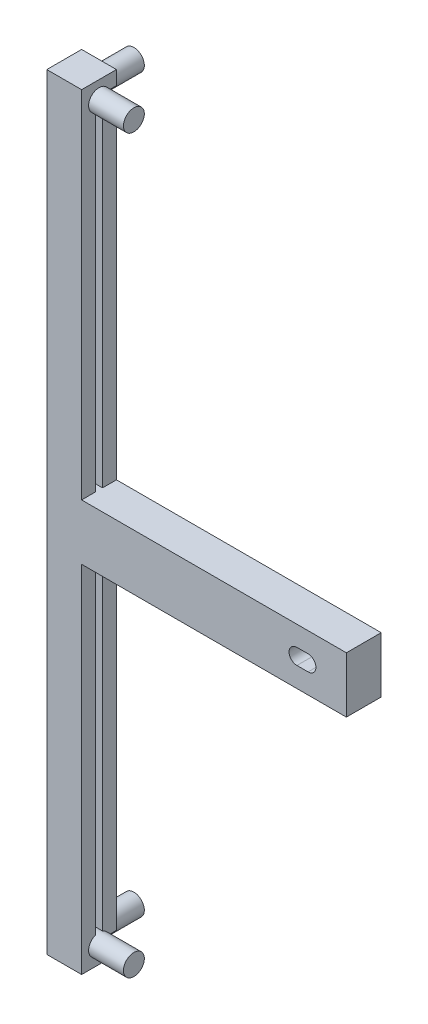
ISO-10303-21;
HEADER;
FILE_DESCRIPTION(('STEP AP214'),'2;1');
FILE_NAME('part.step','',(''),(''),'','','');
FILE_SCHEMA(('AUTOMOTIVE_DESIGN { 1 0 10303 214 1 1 1 1 }'));
ENDSEC;
DATA;
#1=APPLICATION_CONTEXT('core data for automotive mechanical design processes');
#2=APPLICATION_PROTOCOL_DEFINITION('international standard','automotive_design',2000,#1);
#3=PRODUCT_CONTEXT('',#1,'mechanical');
#4=PRODUCT('Part','Part','',(#3));
#5=PRODUCT_RELATED_PRODUCT_CATEGORY('part','',(#4));
#6=PRODUCT_DEFINITION_FORMATION('','',#4);
#7=PRODUCT_DEFINITION_CONTEXT('part definition',#1,'design');
#8=PRODUCT_DEFINITION('design','',#6,#7);
#9=PRODUCT_DEFINITION_SHAPE('','',#8);
#10=(LENGTH_UNIT() NAMED_UNIT(*) SI_UNIT(.MILLI.,.METRE.));
#11=(NAMED_UNIT(*) PLANE_ANGLE_UNIT() SI_UNIT($,.RADIAN.));
#12=(NAMED_UNIT(*) SI_UNIT($,.STERADIAN.) SOLID_ANGLE_UNIT());
#13=UNCERTAINTY_MEASURE_WITH_UNIT(LENGTH_MEASURE(1.E-05),#10,'distance_accuracy_value','');
#14=(GEOMETRIC_REPRESENTATION_CONTEXT(3) GLOBAL_UNCERTAINTY_ASSIGNED_CONTEXT((#13)) GLOBAL_UNIT_ASSIGNED_CONTEXT((#10,
#11,#12)) REPRESENTATION_CONTEXT('',''));
#15=CARTESIAN_POINT('',(0.,0.,0.));
#16=DIRECTION('',(0.,0.,1.));
#17=DIRECTION('',(1.,0.,0.));
#18=AXIS2_PLACEMENT_3D('',#15,#16,#17);
#19=CARTESIAN_POINT('',(0.,-214.,6.5));
#20=DIRECTION('',(0.,1.,0.));
#21=DIRECTION('',(0.,0.,1.));
#22=AXIS2_PLACEMENT_3D('',#19,#20,#21);
#23=PLANE('',#22);
#24=DIRECTION('',(0.,0.,-1.));
#25=VECTOR('',#24,1.);
#26=CARTESIAN_POINT('',(7.82842712474619,-214.,220.));
#27=LINE('',#26,#25);
#28=CARTESIAN_POINT('',(7.82842712474634,-214.,210.));
#29=VERTEX_POINT('',#28);
#30=CARTESIAN_POINT('',(7.82842712474618,-214.,212.171572875254));
#31=VERTEX_POINT('',#30);
#32=EDGE_CURVE('E270',#29,#31,#27,.F.);
#33=ORIENTED_EDGE('',*,*,#32,.F.);
#34=DIRECTION('',(-1.,0.,0.));
#35=VECTOR('',#34,1.);
#36=CARTESIAN_POINT('',(0.,-214.,210.));
#37=LINE('',#36,#35);
#38=CARTESIAN_POINT('',(10.,-214.,210.));
#39=VERTEX_POINT('',#38);
#40=EDGE_CURVE('E481',#39,#29,#37,.T.);
#41=ORIENTED_EDGE('',*,*,#40,.F.);
#42=DIRECTION('',(0.,0.,1.));
#43=VECTOR('',#42,1.);
#44=CARTESIAN_POINT('',(10.,-214.,6.5));
#45=LINE('',#44,#43);
#46=CARTESIAN_POINT('',(10.,-214.,212.171572875254));
#47=VERTEX_POINT('',#46);
#48=EDGE_CURVE('E347',#39,#47,#45,.T.);
#49=ORIENTED_EDGE('',*,*,#48,.T.);
#50=DIRECTION('',(1.,0.,0.));
#51=VECTOR('',#50,1.);
#52=CARTESIAN_POINT('',(0.,-214.,212.171572875254));
#53=LINE('',#52,#51);
#54=EDGE_CURVE('E320',#31,#47,#53,.T.);
#55=ORIENTED_EDGE('',*,*,#54,.F.);
#56=EDGE_LOOP('',(#33,#41,#49,#55));
#57=FACE_BOUND('',#56,.T.);
#58=ADVANCED_FACE('F40',(#57),#23,.F.);
#59=CARTESIAN_POINT('',(0.,-216.,6.5));
#60=DIRECTION('',(0.,1.,0.));
#61=DIRECTION('',(0.,0.,1.));
#62=AXIS2_PLACEMENT_3D('',#59,#60,#61);
#63=PLANE('',#62);
#64=DIRECTION('',(-1.,0.,0.));
#65=VECTOR('',#64,1.);
#66=CARTESIAN_POINT('',(0.,-216.,210.));
#67=LINE('',#66,#65);
#68=CARTESIAN_POINT('',(10.,-216.,210.));
#69=VERTEX_POINT('',#68);
#70=CARTESIAN_POINT('',(7.82842712474604,-216.,210.));
#71=VERTEX_POINT('',#70);
#72=EDGE_CURVE('E267',#69,#71,#67,.T.);
#73=ORIENTED_EDGE('',*,*,#72,.T.);
#74=DIRECTION('',(0.,0.,-1.));
#75=VECTOR('',#74,1.);
#76=CARTESIAN_POINT('',(7.82842712474619,-216.,220.));
#77=LINE('',#76,#75);
#78=CARTESIAN_POINT('',(7.82842712474618,-216.,212.171572875254));
#79=VERTEX_POINT('',#78);
#80=EDGE_CURVE('E264',#71,#79,#77,.F.);
#81=ORIENTED_EDGE('',*,*,#80,.T.);
#82=DIRECTION('',(1.,0.,0.));
#83=VECTOR('',#82,1.);
#84=CARTESIAN_POINT('',(0.,-216.,212.171572875254));
#85=LINE('',#84,#83);
#86=CARTESIAN_POINT('',(10.,-216.,212.171572875254));
#87=VERTEX_POINT('',#86);
#88=EDGE_CURVE('E251',#79,#87,#85,.T.);
#89=ORIENTED_EDGE('',*,*,#88,.T.);
#90=DIRECTION('',(0.,0.,1.));
#91=VECTOR('',#90,1.);
#92=CARTESIAN_POINT('',(10.,-216.,6.5));
#93=LINE('',#92,#91);
#94=EDGE_CURVE('E345',#69,#87,#93,.T.);
#95=ORIENTED_EDGE('',*,*,#94,.F.);
#96=EDGE_LOOP('',(#73,#81,#89,#95));
#97=FACE_BOUND('',#96,.T.);
#98=ADVANCED_FACE('F265',(#97),#63,.T.);
#99=CARTESIAN_POINT('',(6.00000000000001,0.,6.5));
#100=DIRECTION('',(-1.,0.,0.));
#101=DIRECTION('',(0.,-1.,0.));
#102=AXIS2_PLACEMENT_3D('',#99,#100,#101);
#103=PLANE('',#102);
#104=DIRECTION('',(0.,1.,0.));
#105=VECTOR('',#104,1.);
#106=CARTESIAN_POINT('',(5.99999999999963,0.,210.));
#107=LINE('',#106,#105);
#108=CARTESIAN_POINT('',(5.99999999999963,-212.171572875254,210.));
#109=VERTEX_POINT('',#108);
#110=CARTESIAN_POINT('',(5.99999999999963,-7.82842712474632,210.));
#111=VERTEX_POINT('',#110);
#112=EDGE_CURVE('E489',#109,#111,#107,.T.);
#113=ORIENTED_EDGE('',*,*,#112,.F.);
#114=DIRECTION('',(0.,0.,-1.));
#115=VECTOR('',#114,1.);
#116=CARTESIAN_POINT('',(6.00000000000002,-212.171572875254,220.));
#117=LINE('',#116,#115);
#118=CARTESIAN_POINT('',(5.99999999999962,-212.171572875254,213.5));
#119=VERTEX_POINT('',#118);
#120=EDGE_CURVE('E55',#109,#119,#117,.F.);
#121=ORIENTED_EDGE('',*,*,#120,.T.);
#122=DIRECTION('',(0.,-1.,0.));
#123=VECTOR('',#122,1.);
#124=CARTESIAN_POINT('',(5.99999999999962,-6.50000000000001,213.5));
#125=LINE('',#124,#123);
#126=CARTESIAN_POINT('',(5.99999999999962,-7.82842712474619,213.5));
#127=VERTEX_POINT('',#126);
#128=EDGE_CURVE('E362',#127,#119,#125,.T.);
#129=ORIENTED_EDGE('',*,*,#128,.F.);
#130=DIRECTION('',(0.,0.,-1.));
#131=VECTOR('',#130,1.);
#132=CARTESIAN_POINT('',(6.00000000000001,-7.82842712474619,220.));
#133=LINE('',#132,#131);
#134=EDGE_CURVE('E303',#111,#127,#133,.F.);
#135=ORIENTED_EDGE('',*,*,#134,.F.);
#136=EDGE_LOOP('',(#113,#121,#129,#135));
#137=FACE_BOUND('',#136,.T.);
#138=ADVANCED_FACE('F583',(#137),#103,.T.);
#139=CARTESIAN_POINT('',(4.00000000000003,0.,6.5));
#140=DIRECTION('',(-1.,0.,0.));
#141=DIRECTION('',(0.,-1.,0.));
#142=AXIS2_PLACEMENT_3D('',#139,#140,#141);
#143=PLANE('',#142);
#144=DIRECTION('',(0.,0.,-1.));
#145=VECTOR('',#144,1.);
#146=CARTESIAN_POINT('',(4.00000000000002,-212.171572875254,220.));
#147=LINE('',#146,#145);
#148=CARTESIAN_POINT('',(3.99999999999963,-212.171572875254,210.));
#149=VERTEX_POINT('',#148);
#150=CARTESIAN_POINT('',(3.99999999999961,-212.171572875254,213.5));
#151=VERTEX_POINT('',#150);
#152=EDGE_CURVE('E286',#149,#151,#147,.F.);
#153=ORIENTED_EDGE('',*,*,#152,.F.);
#154=DIRECTION('',(0.,1.,0.));
#155=VECTOR('',#154,1.);
#156=CARTESIAN_POINT('',(3.99999999999963,0.,210.));
#157=LINE('',#156,#155);
#158=CARTESIAN_POINT('',(3.99999999999963,-7.82842712474606,210.));
#159=VERTEX_POINT('',#158);
#160=EDGE_CURVE('E491',#149,#159,#157,.T.);
#161=ORIENTED_EDGE('',*,*,#160,.T.);
#162=DIRECTION('',(0.,0.,-1.));
#163=VECTOR('',#162,1.);
#164=CARTESIAN_POINT('',(4.00000000000003,-7.8284271247462,220.));
#165=LINE('',#164,#163);
#166=CARTESIAN_POINT('',(3.99999999999961,-7.8284271247462,213.5));
#167=VERTEX_POINT('',#166);
#168=EDGE_CURVE('E301',#159,#167,#165,.F.);
#169=ORIENTED_EDGE('',*,*,#168,.T.);
#170=DIRECTION('',(0.,-1.,0.));
#171=VECTOR('',#170,1.);
#172=CARTESIAN_POINT('',(3.99999999999961,-6.50000000000001,213.5));
#173=LINE('',#172,#171);
#174=EDGE_CURVE('E364',#167,#151,#173,.T.);
#175=ORIENTED_EDGE('',*,*,#174,.T.);
#176=EDGE_LOOP('',(#153,#161,#169,#175));
#177=FACE_BOUND('',#176,.T.);
#178=ADVANCED_FACE('F587',(#177),#143,.F.);
#179=CARTESIAN_POINT('',(0.,0.,210.));
#180=DIRECTION('',(0.,0.,1.));
#181=DIRECTION('',(1.,0.,0.));
#182=AXIS2_PLACEMENT_3D('',#179,#180,#181);
#183=PLANE('',#182);
#184=CARTESIAN_POINT('',(5.,-215.,210.));
#185=DIRECTION('',(0.,0.,1.));
#186=DIRECTION('',(1.,0.,0.));
#187=AXIS2_PLACEMENT_3D('',#184,#185,#186);
#188=CIRCLE('',#187,3.);
#189=EDGE_CURVE('E282',#71,#149,#188,.F.);
#190=ORIENTED_EDGE('',*,*,#189,.F.);
#191=ORIENTED_EDGE('',*,*,#72,.F.);
#192=DIRECTION('',(0.,1.,0.));
#193=VECTOR('',#192,1.);
#194=CARTESIAN_POINT('',(10.,-158.528956517952,210.));
#195=LINE('',#194,#193);
#196=CARTESIAN_POINT('',(10.,-220.,210.));
#197=VERTEX_POINT('',#196);
#198=EDGE_CURVE('E343',#197,#69,#195,.T.);
#199=ORIENTED_EDGE('',*,*,#198,.F.);
#200=DIRECTION('',(1.,0.,0.));
#201=VECTOR('',#200,1.);
#202=CARTESIAN_POINT('',(0.,-220.,210.));
#203=LINE('',#202,#201);
#204=CARTESIAN_POINT('',(0.,-220.,210.));
#205=VERTEX_POINT('',#204);
#206=EDGE_CURVE('E468',#205,#197,#203,.T.);
#207=ORIENTED_EDGE('',*,*,#206,.F.);
#208=DIRECTION('',(0.,-1.,0.));
#209=VECTOR('',#208,1.);
#210=CARTESIAN_POINT('',(0.,0.,210.));
#211=LINE('',#210,#209);
#212=CARTESIAN_POINT('',(0.,0.,210.));
#213=VERTEX_POINT('',#212);
#214=EDGE_CURVE('E453',#213,#205,#211,.T.);
#215=ORIENTED_EDGE('',*,*,#214,.F.);
#216=DIRECTION('',(-1.,0.,0.));
#217=VECTOR('',#216,1.);
#218=CARTESIAN_POINT('',(0.,0.,210.));
#219=LINE('',#218,#217);
#220=CARTESIAN_POINT('',(10.,0.,210.));
#221=VERTEX_POINT('',#220);
#222=EDGE_CURVE('E460',#221,#213,#219,.T.);
#223=ORIENTED_EDGE('',*,*,#222,.F.);
#224=DIRECTION('',(0.,1.,0.));
#225=VECTOR('',#224,1.);
#226=CARTESIAN_POINT('',(10.,-56.,210.));
#227=LINE('',#226,#225);
#228=CARTESIAN_POINT('',(10.,-4.,210.));
#229=VERTEX_POINT('',#228);
#230=EDGE_CURVE('E341',#229,#221,#227,.T.);
#231=ORIENTED_EDGE('',*,*,#230,.F.);
#232=DIRECTION('',(1.,0.,0.));
#233=VECTOR('',#232,1.);
#234=CARTESIAN_POINT('',(0.,-4.00000000000103,210.));
#235=LINE('',#234,#233);
#236=CARTESIAN_POINT('',(7.82842712474655,-4.00000000000103,210.));
#237=VERTEX_POINT('',#236);
#238=EDGE_CURVE('E479',#237,#229,#235,.T.);
#239=ORIENTED_EDGE('',*,*,#238,.F.);
#240=CARTESIAN_POINT('',(5.,-5.,210.));
#241=DIRECTION('',(0.,0.,1.));
#242=DIRECTION('',(1.,0.,0.));
#243=AXIS2_PLACEMENT_3D('',#240,#241,#242);
#244=CIRCLE('',#243,3.);
#245=EDGE_CURVE('E300',#237,#159,#244,.T.);
#246=ORIENTED_EDGE('',*,*,#245,.T.);
#247=ORIENTED_EDGE('',*,*,#160,.F.);
#248=EDGE_LOOP('',(#190,#191,#199,#207,#215,#223,#231,#239,#246,#247));
#249=FACE_BOUND('',#248,.T.);
#250=ADVANCED_FACE('F516',(#249),#183,.F.);
#251=CARTESIAN_POINT('',(0.,-215.,215.));
#252=DIRECTION('',(1.,0.,0.));
#253=DIRECTION('',(0.,0.,-1.));
#254=AXIS2_PLACEMENT_3D('',#251,#252,#253);
#255=CYLINDRICAL_SURFACE('',#254,2.99999999999999);
#256=CARTESIAN_POINT('',(20.,-215.,215.));
#257=DIRECTION('',(-1.,0.,0.));
#258=DIRECTION('',(0.,0.,1.));
#259=AXIS2_PLACEMENT_3D('',#256,#257,#258);
#260=CIRCLE('',#259,2.99999999999999);
#261=CARTESIAN_POINT('',(20.,-215.,218.));
#262=VERTEX_POINT('',#261);
#263=EDGE_CURVE('E308',#262,#262,#260,.T.);
#264=ORIENTED_EDGE('',*,*,#263,.T.);
#265=EDGE_LOOP('',(#264));
#266=FACE_BOUND('',#265,.T.);
#267=CARTESIAN_POINT('',(5.,-215.,215.));
#268=DIRECTION('',(0.707106781186547,0.,0.707106781186547));
#269=DIRECTION('',(0.707106781186547,0.,-0.707106781186547));
#270=AXIS2_PLACEMENT_3D('',#267,#268,#269);
#271=ELLIPSE('',#270,4.24264068711928,3.);
#272=EDGE_CURVE('E11',#31,#79,#271,.F.);
#273=ORIENTED_EDGE('',*,*,#272,.F.);
#274=ORIENTED_EDGE('',*,*,#54,.T.);
#275=CARTESIAN_POINT('',(10.,-215.,215.));
#276=DIRECTION('',(1.,0.,0.));
#277=DIRECTION('',(0.,0.,-1.));
#278=AXIS2_PLACEMENT_3D('',#275,#276,#277);
#279=CIRCLE('',#278,2.99999999999999);
#280=CARTESIAN_POINT('',(10.,-212.171572875254,214.));
#281=VERTEX_POINT('',#280);
#282=EDGE_CURVE('E317',#281,#47,#279,.F.);
#283=ORIENTED_EDGE('',*,*,#282,.F.);
#284=DIRECTION('',(1.,0.,0.));
#285=VECTOR('',#284,1.);
#286=CARTESIAN_POINT('',(0.,-212.171572875254,214.));
#287=LINE('',#286,#285);
#288=CARTESIAN_POINT('',(6.5,-212.171572875254,214.));
#289=VERTEX_POINT('',#288);
#290=EDGE_CURVE('E311',#281,#289,#287,.F.);
#291=ORIENTED_EDGE('',*,*,#290,.T.);
#292=CARTESIAN_POINT('',(6.5,-215.,215.));
#293=DIRECTION('',(1.,0.,0.));
#294=DIRECTION('',(0.,0.,-1.));
#295=AXIS2_PLACEMENT_3D('',#292,#293,#294);
#296=CIRCLE('',#295,2.99999999999999);
#297=CARTESIAN_POINT('',(6.5,-212.171572875254,216.));
#298=VERTEX_POINT('',#297);
#299=EDGE_CURVE('E314',#298,#289,#296,.F.);
#300=ORIENTED_EDGE('',*,*,#299,.F.);
#301=DIRECTION('',(1.,0.,0.));
#302=VECTOR('',#301,1.);
#303=CARTESIAN_POINT('',(0.,-212.171572875254,216.));
#304=LINE('',#303,#302);
#305=CARTESIAN_POINT('',(10.,-212.171572875254,216.));
#306=VERTEX_POINT('',#305);
#307=EDGE_CURVE('E322',#306,#298,#304,.F.);
#308=ORIENTED_EDGE('',*,*,#307,.F.);
#309=EDGE_CURVE('E256',#87,#306,#279,.F.);
#310=ORIENTED_EDGE('',*,*,#309,.F.);
#311=ORIENTED_EDGE('',*,*,#88,.F.);
#312=EDGE_LOOP('',(#273,#274,#283,#291,#300,#308,#310,#311));
#313=FACE_BOUND('',#312,.T.);
#314=ADVANCED_FACE('F253',(#266,#313),#255,.T.);
#315=CARTESIAN_POINT('',(10.,-10.,220.));
#316=DIRECTION('',(1.,0.,0.));
#317=DIRECTION('',(0.,0.,-1.));
#318=AXIS2_PLACEMENT_3D('',#315,#316,#317);
#319=PLANE('',#318);
#320=ORIENTED_EDGE('',*,*,#94,.T.);
#321=ORIENTED_EDGE('',*,*,#309,.T.);
#322=DIRECTION('',(0.,1.,0.));
#323=VECTOR('',#322,1.);
#324=CARTESIAN_POINT('',(10.,-10.,216.));
#325=LINE('',#324,#323);
#326=CARTESIAN_POINT('',(10.,-118.,216.));
#327=VERTEX_POINT('',#326);
#328=EDGE_CURVE('E448',#306,#327,#325,.T.);
#329=ORIENTED_EDGE('',*,*,#328,.T.);
#330=DIRECTION('',(0.,0.,-1.));
#331=VECTOR('',#330,1.);
#332=CARTESIAN_POINT('',(10.,-118.,220.));
#333=LINE('',#332,#331);
#334=CARTESIAN_POINT('',(10.,-118.,220.));
#335=VERTEX_POINT('',#334);
#336=EDGE_CURVE('E435',#335,#327,#333,.T.);
#337=ORIENTED_EDGE('',*,*,#336,.F.);
#338=DIRECTION('',(0.,-1.,0.));
#339=VECTOR('',#338,1.);
#340=CARTESIAN_POINT('',(10.,-10.,220.));
#341=LINE('',#340,#339);
#342=CARTESIAN_POINT('',(10.,-220.,220.));
#343=VERTEX_POINT('',#342);
#344=EDGE_CURVE('E454',#335,#343,#341,.T.);
#345=ORIENTED_EDGE('',*,*,#344,.T.);
#346=DIRECTION('',(0.,0.,1.));
#347=VECTOR('',#346,1.);
#348=CARTESIAN_POINT('',(10.,-220.,10.));
#349=LINE('',#348,#347);
#350=EDGE_CURVE('E350',#197,#343,#349,.T.);
#351=ORIENTED_EDGE('',*,*,#350,.F.);
#352=ORIENTED_EDGE('',*,*,#198,.T.);
#353=EDGE_LOOP('',(#320,#321,#329,#337,#345,#351,#352));
#354=FACE_BOUND('',#353,.T.);
#355=ADVANCED_FACE('F597',(#354),#319,.T.);
#356=CARTESIAN_POINT('',(6.5,-6.50000000000001,216.));
#357=DIRECTION('',(0.,0.,-1.));
#358=DIRECTION('',(-1.,0.,0.));
#359=AXIS2_PLACEMENT_3D('',#356,#357,#358);
#360=PLANE('',#359);
#361=ORIENTED_EDGE('',*,*,#328,.F.);
#362=ORIENTED_EDGE('',*,*,#307,.T.);
#363=DIRECTION('',(0.,-1.,0.));
#364=VECTOR('',#363,1.);
#365=CARTESIAN_POINT('',(6.5,-6.50000000000001,216.));
#366=LINE('',#365,#364);
#367=CARTESIAN_POINT('',(6.5,-118.,216.));
#368=VERTEX_POINT('',#367);
#369=EDGE_CURVE('E441',#368,#298,#366,.T.);
#370=ORIENTED_EDGE('',*,*,#369,.F.);
#371=DIRECTION('',(-1.,0.,0.));
#372=VECTOR('',#371,1.);
#373=CARTESIAN_POINT('',(6.5,-118.,216.));
#374=LINE('',#373,#372);
#375=EDGE_CURVE('E432',#327,#368,#374,.T.);
#376=ORIENTED_EDGE('',*,*,#375,.F.);
#377=EDGE_LOOP('',(#361,#362,#370,#376));
#378=FACE_BOUND('',#377,.T.);
#379=ADVANCED_FACE('F601',(#378),#360,.T.);
#380=CARTESIAN_POINT('',(6.5,-6.50000000000001,214.));
#381=DIRECTION('',(0.,0.,-1.));
#382=DIRECTION('',(-1.,0.,0.));
#383=AXIS2_PLACEMENT_3D('',#380,#381,#382);
#384=PLANE('',#383);
#385=ORIENTED_EDGE('',*,*,#290,.F.);
#386=DIRECTION('',(0.,1.,0.));
#387=VECTOR('',#386,1.);
#388=CARTESIAN_POINT('',(10.,-10.,214.));
#389=LINE('',#388,#387);
#390=CARTESIAN_POINT('',(10.,-118.,214.));
#391=VERTEX_POINT('',#390);
#392=EDGE_CURVE('E445',#281,#391,#389,.T.);
#393=ORIENTED_EDGE('',*,*,#392,.T.);
#394=DIRECTION('',(-1.,0.,0.));
#395=VECTOR('',#394,1.);
#396=CARTESIAN_POINT('',(6.5,-118.,214.));
#397=LINE('',#396,#395);
#398=CARTESIAN_POINT('',(6.5,-118.,214.));
#399=VERTEX_POINT('',#398);
#400=EDGE_CURVE('E487',#391,#399,#397,.T.);
#401=ORIENTED_EDGE('',*,*,#400,.T.);
#402=DIRECTION('',(0.,-1.,0.));
#403=VECTOR('',#402,1.);
#404=CARTESIAN_POINT('',(6.5,-6.50000000000001,214.));
#405=LINE('',#404,#403);
#406=EDGE_CURVE('E438',#399,#289,#405,.T.);
#407=ORIENTED_EDGE('',*,*,#406,.T.);
#408=EDGE_LOOP('',(#385,#393,#401,#407));
#409=FACE_BOUND('',#408,.T.);
#410=ADVANCED_FACE('F604',(#409),#384,.F.);
#411=CARTESIAN_POINT('',(5.99999999999962,-6.50000000000001,213.5));
#412=DIRECTION('',(0.,0.,1.));
#413=DIRECTION('',(1.,0.,0.));
#414=AXIS2_PLACEMENT_3D('',#411,#412,#413);
#415=PLANE('',#414);
#416=CARTESIAN_POINT('',(5.,-215.,213.5));
#417=DIRECTION('',(0.,0.,1.));
#418=DIRECTION('',(1.,0.,0.));
#419=AXIS2_PLACEMENT_3D('',#416,#417,#418);
#420=CIRCLE('',#419,3.);
#421=EDGE_CURVE('E62',#151,#119,#420,.F.);
#422=ORIENTED_EDGE('',*,*,#421,.F.);
#423=ORIENTED_EDGE('',*,*,#174,.F.);
#424=CARTESIAN_POINT('',(5.,-5.,213.5));
#425=DIRECTION('',(0.,0.,1.));
#426=DIRECTION('',(1.,0.,0.));
#427=AXIS2_PLACEMENT_3D('',#424,#425,#426);
#428=CIRCLE('',#427,3.);
#429=EDGE_CURVE('E306',#167,#127,#428,.T.);
#430=ORIENTED_EDGE('',*,*,#429,.T.);
#431=ORIENTED_EDGE('',*,*,#128,.T.);
#432=EDGE_LOOP('',(#422,#423,#430,#431));
#433=FACE_BOUND('',#432,.T.);
#434=ADVANCED_FACE('F608',(#433),#415,.F.);
#435=CARTESIAN_POINT('',(10.,-5.,215.));
#436=DIRECTION('',(1.,0.,0.));
#437=DIRECTION('',(0.,0.,-1.));
#438=AXIS2_PLACEMENT_3D('',#435,#436,#437);
#439=CIRCLE('',#438,2.99999999999999);
#440=CARTESIAN_POINT('',(10.,-4.,212.171572875254));
#441=VERTEX_POINT('',#440);
#442=CARTESIAN_POINT('',(10.,-7.82842712474618,216.));
#443=VERTEX_POINT('',#442);
#444=EDGE_CURVE('E333',#441,#443,#439,.T.);
#445=ORIENTED_EDGE('',*,*,#444,.F.);
#446=DIRECTION('',(0.,0.,1.));
#447=VECTOR('',#446,1.);
#448=CARTESIAN_POINT('',(10.,-4.,6.5));
#449=LINE('',#448,#447);
#450=EDGE_CURVE('E353',#229,#441,#449,.T.);
#451=ORIENTED_EDGE('',*,*,#450,.F.);
#452=ORIENTED_EDGE('',*,*,#230,.T.);
#453=DIRECTION('',(0.,0.,-1.));
#454=VECTOR('',#453,1.);
#455=CARTESIAN_POINT('',(10.,0.,10.));
#456=LINE('',#455,#454);
#457=CARTESIAN_POINT('',(10.,0.,220.));
#458=VERTEX_POINT('',#457);
#459=EDGE_CURVE('E359',#458,#221,#456,.T.);
#460=ORIENTED_EDGE('',*,*,#459,.F.);
#461=CARTESIAN_POINT('',(10.,-102.,220.));
#462=VERTEX_POINT('',#461);
#463=EDGE_CURVE('E451',#458,#462,#341,.T.);
#464=ORIENTED_EDGE('',*,*,#463,.T.);
#465=DIRECTION('',(0.,0.,-1.));
#466=VECTOR('',#465,1.);
#467=CARTESIAN_POINT('',(10.,-102.,220.));
#468=LINE('',#467,#466);
#469=CARTESIAN_POINT('',(10.,-102.,216.));
#470=VERTEX_POINT('',#469);
#471=EDGE_CURVE('E424',#462,#470,#468,.T.);
#472=ORIENTED_EDGE('',*,*,#471,.T.);
#473=EDGE_CURVE('E447',#470,#443,#325,.T.);
#474=ORIENTED_EDGE('',*,*,#473,.T.);
#475=EDGE_LOOP('',(#445,#451,#452,#460,#464,#472,#474));
#476=FACE_BOUND('',#475,.T.);
#477=ADVANCED_FACE('F511',(#476),#319,.T.);
#478=DIRECTION('',(1.,0.,0.));
#479=VECTOR('',#478,1.);
#480=CARTESIAN_POINT('',(0.,-7.82842712474618,216.));
#481=LINE('',#480,#479);
#482=CARTESIAN_POINT('',(6.5,-7.82842712474618,216.));
#483=VERTEX_POINT('',#482);
#484=EDGE_CURVE('E337',#443,#483,#481,.F.);
#485=ORIENTED_EDGE('',*,*,#484,.F.);
#486=ORIENTED_EDGE('',*,*,#473,.F.);
#487=DIRECTION('',(-1.,0.,0.));
#488=VECTOR('',#487,1.);
#489=CARTESIAN_POINT('',(6.5,-102.,216.));
#490=LINE('',#489,#488);
#491=CARTESIAN_POINT('',(6.5,-102.,216.));
#492=VERTEX_POINT('',#491);
#493=EDGE_CURVE('E421',#470,#492,#490,.T.);
#494=ORIENTED_EDGE('',*,*,#493,.T.);
#495=EDGE_CURVE('E442',#483,#492,#366,.T.);
#496=ORIENTED_EDGE('',*,*,#495,.F.);
#497=EDGE_LOOP('',(#485,#486,#494,#496));
#498=FACE_BOUND('',#497,.T.);
#499=ADVANCED_FACE('F565',(#498),#360,.T.);
#500=CARTESIAN_POINT('',(10.,-102.,214.));
#501=VERTEX_POINT('',#500);
#502=CARTESIAN_POINT('',(10.,-7.82842712474618,214.));
#503=VERTEX_POINT('',#502);
#504=EDGE_CURVE('E444',#501,#503,#389,.T.);
#505=ORIENTED_EDGE('',*,*,#504,.T.);
#506=DIRECTION('',(1.,0.,0.));
#507=VECTOR('',#506,1.);
#508=CARTESIAN_POINT('',(0.,-7.82842712474618,214.));
#509=LINE('',#508,#507);
#510=CARTESIAN_POINT('',(6.5,-7.82842712474618,214.));
#511=VERTEX_POINT('',#510);
#512=EDGE_CURVE('E334',#503,#511,#509,.F.);
#513=ORIENTED_EDGE('',*,*,#512,.T.);
#514=CARTESIAN_POINT('',(6.5,-102.,214.));
#515=VERTEX_POINT('',#514);
#516=EDGE_CURVE('E439',#511,#515,#405,.T.);
#517=ORIENTED_EDGE('',*,*,#516,.T.);
#518=DIRECTION('',(-1.,0.,0.));
#519=VECTOR('',#518,1.);
#520=CARTESIAN_POINT('',(6.5,-102.,214.));
#521=LINE('',#520,#519);
#522=EDGE_CURVE('E484',#501,#515,#521,.T.);
#523=ORIENTED_EDGE('',*,*,#522,.F.);
#524=EDGE_LOOP('',(#505,#513,#517,#523));
#525=FACE_BOUND('',#524,.T.);
#526=ADVANCED_FACE('F557',(#525),#384,.F.);
#527=CARTESIAN_POINT('',(10.,-6.,212.171572875254));
#528=VERTEX_POINT('',#527);
#529=EDGE_CURVE('E331',#503,#528,#439,.T.);
#530=ORIENTED_EDGE('',*,*,#529,.F.);
#531=ORIENTED_EDGE('',*,*,#504,.F.);
#532=DIRECTION('',(0.,0.,-1.));
#533=VECTOR('',#532,1.);
#534=CARTESIAN_POINT('',(10.,-102.,220.));
#535=LINE('',#534,#533);
#536=CARTESIAN_POINT('',(10.,-102.,210.));
#537=VERTEX_POINT('',#536);
#538=EDGE_CURVE('E418',#501,#537,#535,.T.);
#539=ORIENTED_EDGE('',*,*,#538,.T.);
#540=DIRECTION('',(0.,-1.,0.));
#541=VECTOR('',#540,1.);
#542=CARTESIAN_POINT('',(10.,-10.,210.));
#543=LINE('',#542,#541);
#544=CARTESIAN_POINT('',(10.,-6.00000000000107,210.));
#545=VERTEX_POINT('',#544);
#546=EDGE_CURVE('E455',#545,#537,#543,.T.);
#547=ORIENTED_EDGE('',*,*,#546,.F.);
#548=DIRECTION('',(0.,0.,1.));
#549=VECTOR('',#548,1.);
#550=CARTESIAN_POINT('',(10.,-6.,6.5));
#551=LINE('',#550,#549);
#552=EDGE_CURVE('E356',#545,#528,#551,.T.);
#553=ORIENTED_EDGE('',*,*,#552,.T.);
#554=EDGE_LOOP('',(#530,#531,#539,#547,#553));
#555=FACE_BOUND('',#554,.T.);
#556=ADVANCED_FACE('F554',(#555),#319,.T.);
#557=CARTESIAN_POINT('',(6.5,-6.50000000000001,214.));
#558=DIRECTION('',(1.,0.,0.));
#559=DIRECTION('',(0.,0.,-1.));
#560=AXIS2_PLACEMENT_3D('',#557,#558,#559);
#561=PLANE('',#560);
#562=CARTESIAN_POINT('',(6.5,-5.,215.));
#563=DIRECTION('',(1.,0.,0.));
#564=DIRECTION('',(0.,0.,-1.));
#565=AXIS2_PLACEMENT_3D('',#562,#563,#564);
#566=CIRCLE('',#565,2.99999999999999);
#567=EDGE_CURVE('E339',#483,#511,#566,.T.);
#568=ORIENTED_EDGE('',*,*,#567,.F.);
#569=ORIENTED_EDGE('',*,*,#495,.T.);
#570=DIRECTION('',(0.,0.,-1.));
#571=VECTOR('',#570,1.);
#572=CARTESIAN_POINT('',(6.5,-102.,214.));
#573=LINE('',#572,#571);
#574=EDGE_CURVE('E403',#492,#515,#573,.T.);
#575=ORIENTED_EDGE('',*,*,#574,.T.);
#576=ORIENTED_EDGE('',*,*,#516,.F.);
#577=EDGE_LOOP('',(#568,#569,#575,#576));
#578=FACE_BOUND('',#577,.T.);
#579=ADVANCED_FACE('F561',(#578),#561,.T.);
#580=CARTESIAN_POINT('',(0.,0.,10.));
#581=DIRECTION('',(1.,0.,0.));
#582=DIRECTION('',(0.,1.,0.));
#583=AXIS2_PLACEMENT_3D('',#580,#581,#582);
#584=PLANE('',#583);
#585=DIRECTION('',(0.,0.,-1.));
#586=VECTOR('',#585,1.);
#587=CARTESIAN_POINT('',(0.,0.,10.));
#588=LINE('',#587,#586);
#589=CARTESIAN_POINT('',(0.,0.,220.));
#590=VERTEX_POINT('',#589);
#591=EDGE_CURVE('E465',#590,#213,#588,.T.);
#592=ORIENTED_EDGE('',*,*,#591,.T.);
#593=ORIENTED_EDGE('',*,*,#214,.T.);
#594=DIRECTION('',(0.,0.,-1.));
#595=VECTOR('',#594,1.);
#596=CARTESIAN_POINT('',(0.,-220.,10.));
#597=LINE('',#596,#595);
#598=CARTESIAN_POINT('',(0.,-220.,220.));
#599=VERTEX_POINT('',#598);
#600=EDGE_CURVE('E474',#599,#205,#597,.T.);
#601=ORIENTED_EDGE('',*,*,#600,.F.);
#602=DIRECTION('',(0.,-1.,0.));
#603=VECTOR('',#602,1.);
#604=CARTESIAN_POINT('',(0.,0.,220.));
#605=LINE('',#604,#603);
#606=EDGE_CURVE('E457',#590,#599,#605,.T.);
#607=ORIENTED_EDGE('',*,*,#606,.F.);
#608=EDGE_LOOP('',(#592,#593,#601,#607));
#609=FACE_BOUND('',#608,.T.);
#610=ADVANCED_FACE('F42',(#609),#584,.F.);
#611=CARTESIAN_POINT('',(0.,-220.,10.));
#612=DIRECTION('',(0.,1.,0.));
#613=DIRECTION('',(0.,0.,1.));
#614=AXIS2_PLACEMENT_3D('',#611,#612,#613);
#615=PLANE('',#614);
#616=ORIENTED_EDGE('',*,*,#206,.T.);
#617=ORIENTED_EDGE('',*,*,#350,.T.);
#618=DIRECTION('',(1.,0.,0.));
#619=VECTOR('',#618,1.);
#620=CARTESIAN_POINT('',(0.,-220.,220.));
#621=LINE('',#620,#619);
#622=EDGE_CURVE('E459',#599,#343,#621,.T.);
#623=ORIENTED_EDGE('',*,*,#622,.F.);
#624=ORIENTED_EDGE('',*,*,#600,.T.);
#625=EDGE_LOOP('',(#616,#617,#623,#624));
#626=FACE_BOUND('',#625,.T.);
#627=ADVANCED_FACE('F575',(#626),#615,.F.);
#628=CARTESIAN_POINT('',(0.,0.,10.));
#629=DIRECTION('',(0.,-1.,0.));
#630=DIRECTION('',(0.,0.,-1.));
#631=AXIS2_PLACEMENT_3D('',#628,#629,#630);
#632=PLANE('',#631);
#633=DIRECTION('',(-1.,0.,0.));
#634=VECTOR('',#633,1.);
#635=CARTESIAN_POINT('',(0.,0.,220.));
#636=LINE('',#635,#634);
#637=EDGE_CURVE('E463',#458,#590,#636,.T.);
#638=ORIENTED_EDGE('',*,*,#637,.F.);
#639=ORIENTED_EDGE('',*,*,#459,.T.);
#640=ORIENTED_EDGE('',*,*,#222,.T.);
#641=ORIENTED_EDGE('',*,*,#591,.F.);
#642=EDGE_LOOP('',(#638,#639,#640,#641));
#643=FACE_BOUND('',#642,.T.);
#644=ADVANCED_FACE('F522',(#643),#632,.F.);
#645=CARTESIAN_POINT('',(0.,-6.,6.5));
#646=DIRECTION('',(0.,1.,0.));
#647=DIRECTION('',(0.,0.,1.));
#648=AXIS2_PLACEMENT_3D('',#645,#646,#647);
#649=PLANE('',#648);
#650=DIRECTION('',(0.,0.,-1.));
#651=VECTOR('',#650,1.);
#652=CARTESIAN_POINT('',(7.82842712474619,-6.,220.));
#653=LINE('',#652,#651);
#654=CARTESIAN_POINT('',(7.82842712474618,-6.,212.171572875254));
#655=VERTEX_POINT('',#654);
#656=CARTESIAN_POINT('',(7.82842712474583,-6.00000000000103,210.));
#657=VERTEX_POINT('',#656);
#658=EDGE_CURVE('E295',#655,#657,#653,.T.);
#659=ORIENTED_EDGE('',*,*,#658,.F.);
#660=DIRECTION('',(1.,0.,0.));
#661=VECTOR('',#660,1.);
#662=CARTESIAN_POINT('',(0.,-6.,212.171572875254));
#663=LINE('',#662,#661);
#664=EDGE_CURVE('E329',#528,#655,#663,.F.);
#665=ORIENTED_EDGE('',*,*,#664,.F.);
#666=ORIENTED_EDGE('',*,*,#552,.F.);
#667=DIRECTION('',(1.,0.,0.));
#668=VECTOR('',#667,1.);
#669=CARTESIAN_POINT('',(0.,-6.00000000000103,210.));
#670=LINE('',#669,#668);
#671=EDGE_CURVE('E477',#657,#545,#670,.T.);
#672=ORIENTED_EDGE('',*,*,#671,.F.);
#673=EDGE_LOOP('',(#659,#665,#666,#672));
#674=FACE_BOUND('',#673,.T.);
#675=ADVANCED_FACE('F567',(#674),#649,.T.);
#676=CARTESIAN_POINT('',(0.,-4.,6.5));
#677=DIRECTION('',(0.,1.,0.));
#678=DIRECTION('',(0.,0.,1.));
#679=AXIS2_PLACEMENT_3D('',#676,#677,#678);
#680=PLANE('',#679);
#681=DIRECTION('',(1.,0.,0.));
#682=VECTOR('',#681,1.);
#683=CARTESIAN_POINT('',(0.,-4.,212.171572875254));
#684=LINE('',#683,#682);
#685=CARTESIAN_POINT('',(7.82842712474618,-4.,212.171572875254));
#686=VERTEX_POINT('',#685);
#687=EDGE_CURVE('E326',#441,#686,#684,.F.);
#688=ORIENTED_EDGE('',*,*,#687,.T.);
#689=DIRECTION('',(0.,0.,-1.));
#690=VECTOR('',#689,1.);
#691=CARTESIAN_POINT('',(7.82842712474619,-4.,220.));
#692=LINE('',#691,#690);
#693=EDGE_CURVE('E293',#686,#237,#692,.T.);
#694=ORIENTED_EDGE('',*,*,#693,.T.);
#695=ORIENTED_EDGE('',*,*,#238,.T.);
#696=ORIENTED_EDGE('',*,*,#450,.T.);
#697=EDGE_LOOP('',(#688,#694,#695,#696));
#698=FACE_BOUND('',#697,.T.);
#699=ADVANCED_FACE('F506',(#698),#680,.F.);
#700=EDGE_CURVE('E277',#109,#29,#188,.F.);
#701=ORIENTED_EDGE('',*,*,#700,.F.);
#702=ORIENTED_EDGE('',*,*,#112,.T.);
#703=EDGE_CURVE('E298',#111,#657,#244,.T.);
#704=ORIENTED_EDGE('',*,*,#703,.T.);
#705=ORIENTED_EDGE('',*,*,#671,.T.);
#706=ORIENTED_EDGE('',*,*,#546,.T.);
#707=DIRECTION('',(1.,0.,0.));
#708=VECTOR('',#707,1.);
#709=CARTESIAN_POINT('',(0.,-102.,210.));
#710=LINE('',#709,#708);
#711=CARTESIAN_POINT('',(86.,-102.,210.));
#712=VERTEX_POINT('',#711);
#713=EDGE_CURVE('E380',#537,#712,#710,.T.);
#714=ORIENTED_EDGE('',*,*,#713,.T.);
#715=DIRECTION('',(0.,-1.,0.));
#716=VECTOR('',#715,1.);
#717=CARTESIAN_POINT('',(86.,0.,210.));
#718=LINE('',#717,#716);
#719=CARTESIAN_POINT('',(86.,-118.,210.));
#720=VERTEX_POINT('',#719);
#721=EDGE_CURVE('E377',#712,#720,#718,.T.);
#722=ORIENTED_EDGE('',*,*,#721,.T.);
#723=DIRECTION('',(1.,0.,0.));
#724=VECTOR('',#723,1.);
#725=CARTESIAN_POINT('',(0.,-118.,210.));
#726=LINE('',#725,#724);
#727=CARTESIAN_POINT('',(10.,-118.,210.));
#728=VERTEX_POINT('',#727);
#729=EDGE_CURVE('E382',#728,#720,#726,.T.);
#730=ORIENTED_EDGE('',*,*,#729,.F.);
#731=EDGE_CURVE('E450',#728,#39,#543,.T.);
#732=ORIENTED_EDGE('',*,*,#731,.T.);
#733=ORIENTED_EDGE('',*,*,#40,.T.);
#734=EDGE_LOOP('',(#701,#702,#704,#705,#706,#714,#722,#730,#732,#733));
#735=FACE_BOUND('',#734,.T.);
#736=CARTESIAN_POINT('',(75.,-110.,210.));
#737=DIRECTION('',(0.,0.,1.));
#738=DIRECTION('',(1.,0.,0.));
#739=AXIS2_PLACEMENT_3D('',#736,#737,#738);
#740=CIRCLE('',#739,2.25);
#741=CARTESIAN_POINT('',(75.,-112.25,210.));
#742=VERTEX_POINT('',#741);
#743=CARTESIAN_POINT('',(75.,-107.75,210.));
#744=VERTEX_POINT('',#743);
#745=EDGE_CURVE('E367',#742,#744,#740,.T.);
#746=ORIENTED_EDGE('',*,*,#745,.T.);
#747=DIRECTION('',(1.,0.,0.));
#748=VECTOR('',#747,1.);
#749=CARTESIAN_POINT('',(9.35028245160455E-13,-107.750000000001,210.));
#750=LINE('',#749,#748);
#751=CARTESIAN_POINT('',(71.8015262768123,-107.75,210.));
#752=VERTEX_POINT('',#751);
#753=EDGE_CURVE('E374',#752,#744,#750,.T.);
#754=ORIENTED_EDGE('',*,*,#753,.F.);
#755=CARTESIAN_POINT('',(71.8015262768123,-110.,210.));
#756=DIRECTION('',(0.,0.,1.));
#757=DIRECTION('',(1.,0.,0.));
#758=AXIS2_PLACEMENT_3D('',#755,#756,#757);
#759=CIRCLE('',#758,2.24999999999997);
#760=CARTESIAN_POINT('',(71.8015262768123,-112.25,210.));
#761=VERTEX_POINT('',#760);
#762=EDGE_CURVE('E372',#752,#761,#759,.T.);
#763=ORIENTED_EDGE('',*,*,#762,.T.);
#764=DIRECTION('',(1.,0.,0.));
#765=VECTOR('',#764,1.);
#766=CARTESIAN_POINT('',(-9.74078148670625E-13,-112.249999999999,210.));
#767=LINE('',#766,#765);
#768=EDGE_CURVE('E369',#761,#742,#767,.T.);
#769=ORIENTED_EDGE('',*,*,#768,.T.);
#770=EDGE_LOOP('',(#746,#754,#763,#769));
#771=FACE_BOUND('',#770,.T.);
#772=ADVANCED_FACE('F545',(#735,#771),#183,.F.);
#773=CARTESIAN_POINT('',(0.,0.,220.));
#774=DIRECTION('',(0.,0.,1.));
#775=DIRECTION('',(1.,0.,0.));
#776=AXIS2_PLACEMENT_3D('',#773,#774,#775);
#777=PLANE('',#776);
#778=ORIENTED_EDGE('',*,*,#463,.F.);
#779=ORIENTED_EDGE('',*,*,#637,.T.);
#780=ORIENTED_EDGE('',*,*,#606,.T.);
#781=ORIENTED_EDGE('',*,*,#622,.T.);
#782=ORIENTED_EDGE('',*,*,#344,.F.);
#783=DIRECTION('',(1.,0.,0.));
#784=VECTOR('',#783,1.);
#785=CARTESIAN_POINT('',(0.,-118.,220.));
#786=LINE('',#785,#784);
#787=CARTESIAN_POINT('',(86.,-118.,220.));
#788=VERTEX_POINT('',#787);
#789=EDGE_CURVE('E370',#335,#788,#786,.T.);
#790=ORIENTED_EDGE('',*,*,#789,.T.);
#791=DIRECTION('',(0.,-1.,0.));
#792=VECTOR('',#791,1.);
#793=CARTESIAN_POINT('',(86.,0.,220.));
#794=LINE('',#793,#792);
#795=CARTESIAN_POINT('',(86.,-102.,220.));
#796=VERTEX_POINT('',#795);
#797=EDGE_CURVE('E394',#796,#788,#794,.T.);
#798=ORIENTED_EDGE('',*,*,#797,.F.);
#799=DIRECTION('',(1.,0.,0.));
#800=VECTOR('',#799,1.);
#801=CARTESIAN_POINT('',(0.,-102.,220.));
#802=LINE('',#801,#800);
#803=EDGE_CURVE('E397',#462,#796,#802,.T.);
#804=ORIENTED_EDGE('',*,*,#803,.F.);
#805=EDGE_LOOP('',(#778,#779,#780,#781,#782,#790,#798,#804));
#806=FACE_BOUND('',#805,.T.);
#807=CARTESIAN_POINT('',(75.,-110.,220.));
#808=DIRECTION('',(0.,0.,1.));
#809=DIRECTION('',(1.,0.,0.));
#810=AXIS2_PLACEMENT_3D('',#807,#808,#809);
#811=CIRCLE('',#810,2.25);
#812=CARTESIAN_POINT('',(75.,-112.25,220.));
#813=VERTEX_POINT('',#812);
#814=CARTESIAN_POINT('',(75.,-107.75,220.));
#815=VERTEX_POINT('',#814);
#816=EDGE_CURVE('E366',#813,#815,#811,.T.);
#817=ORIENTED_EDGE('',*,*,#816,.F.);
#818=DIRECTION('',(1.,0.,0.));
#819=VECTOR('',#818,1.);
#820=CARTESIAN_POINT('',(-9.74078148670625E-13,-112.249999999999,220.));
#821=LINE('',#820,#819);
#822=CARTESIAN_POINT('',(71.8015262768123,-112.25,220.));
#823=VERTEX_POINT('',#822);
#824=EDGE_CURVE('E387',#823,#813,#821,.T.);
#825=ORIENTED_EDGE('',*,*,#824,.F.);
#826=CARTESIAN_POINT('',(71.8015262768123,-110.,220.));
#827=DIRECTION('',(0.,0.,1.));
#828=DIRECTION('',(1.,0.,0.));
#829=AXIS2_PLACEMENT_3D('',#826,#827,#828);
#830=CIRCLE('',#829,2.24999999999997);
#831=CARTESIAN_POINT('',(71.8015262768123,-107.75,220.));
#832=VERTEX_POINT('',#831);
#833=EDGE_CURVE('E389',#832,#823,#830,.T.);
#834=ORIENTED_EDGE('',*,*,#833,.F.);
#835=DIRECTION('',(1.,0.,0.));
#836=VECTOR('',#835,1.);
#837=CARTESIAN_POINT('',(9.35028245160455E-13,-107.750000000001,220.));
#838=LINE('',#837,#836);
#839=EDGE_CURVE('E391',#832,#815,#838,.T.);
#840=ORIENTED_EDGE('',*,*,#839,.T.);
#841=EDGE_LOOP('',(#817,#825,#834,#840));
#842=FACE_BOUND('',#841,.T.);
#843=ADVANCED_FACE('F534',(#806,#842),#777,.T.);
#844=ORIENTED_EDGE('',*,*,#392,.F.);
#845=ORIENTED_EDGE('',*,*,#282,.T.);
#846=ORIENTED_EDGE('',*,*,#48,.F.);
#847=ORIENTED_EDGE('',*,*,#731,.F.);
#848=DIRECTION('',(0.,0.,-1.));
#849=VECTOR('',#848,1.);
#850=CARTESIAN_POINT('',(10.,-118.,220.));
#851=LINE('',#850,#849);
#852=EDGE_CURVE('E429',#391,#728,#851,.T.);
#853=ORIENTED_EDGE('',*,*,#852,.F.);
#854=EDGE_LOOP('',(#844,#845,#846,#847,#853));
#855=FACE_BOUND('',#854,.T.);
#856=ADVANCED_FACE('F592',(#855),#319,.T.);
#857=ORIENTED_EDGE('',*,*,#369,.T.);
#858=ORIENTED_EDGE('',*,*,#299,.T.);
#859=ORIENTED_EDGE('',*,*,#406,.F.);
#860=DIRECTION('',(0.,0.,-1.));
#861=VECTOR('',#860,1.);
#862=CARTESIAN_POINT('',(6.5,-118.,214.));
#863=LINE('',#862,#861);
#864=EDGE_CURVE('E426',#368,#399,#863,.T.);
#865=ORIENTED_EDGE('',*,*,#864,.F.);
#866=EDGE_LOOP('',(#857,#858,#859,#865));
#867=FACE_BOUND('',#866,.T.);
#868=ADVANCED_FACE('F595',(#867),#561,.T.);
#869=CARTESIAN_POINT('',(86.,0.,210.));
#870=DIRECTION('',(-1.,0.,0.));
#871=DIRECTION('',(0.,0.,1.));
#872=AXIS2_PLACEMENT_3D('',#869,#870,#871);
#873=PLANE('',#872);
#874=ORIENTED_EDGE('',*,*,#797,.T.);
#875=DIRECTION('',(0.,0.,1.));
#876=VECTOR('',#875,1.);
#877=CARTESIAN_POINT('',(86.,-118.,210.));
#878=LINE('',#877,#876);
#879=EDGE_CURVE('E400',#720,#788,#878,.T.);
#880=ORIENTED_EDGE('',*,*,#879,.F.);
#881=ORIENTED_EDGE('',*,*,#721,.F.);
#882=DIRECTION('',(0.,0.,1.));
#883=VECTOR('',#882,1.);
#884=CARTESIAN_POINT('',(86.,-102.,210.));
#885=LINE('',#884,#883);
#886=EDGE_CURVE('E404',#712,#796,#885,.T.);
#887=ORIENTED_EDGE('',*,*,#886,.T.);
#888=EDGE_LOOP('',(#874,#880,#881,#887));
#889=FACE_BOUND('',#888,.T.);
#890=ADVANCED_FACE('F540',(#889),#873,.F.);
#891=CARTESIAN_POINT('',(0.,-118.,210.));
#892=DIRECTION('',(0.,-1.,0.));
#893=DIRECTION('',(0.,0.,-1.));
#894=AXIS2_PLACEMENT_3D('',#891,#892,#893);
#895=PLANE('',#894);
#896=ORIENTED_EDGE('',*,*,#789,.F.);
#897=ORIENTED_EDGE('',*,*,#336,.T.);
#898=ORIENTED_EDGE('',*,*,#375,.T.);
#899=ORIENTED_EDGE('',*,*,#864,.T.);
#900=ORIENTED_EDGE('',*,*,#400,.F.);
#901=ORIENTED_EDGE('',*,*,#852,.T.);
#902=ORIENTED_EDGE('',*,*,#729,.T.);
#903=ORIENTED_EDGE('',*,*,#879,.T.);
#904=EDGE_LOOP('',(#896,#897,#898,#899,#900,#901,#902,#903));
#905=FACE_BOUND('',#904,.T.);
#906=ADVANCED_FACE('F614',(#905),#895,.T.);
#907=CARTESIAN_POINT('',(75.,-110.,210.));
#908=DIRECTION('',(0.,0.,1.));
#909=DIRECTION('',(1.,0.,0.));
#910=AXIS2_PLACEMENT_3D('',#907,#908,#909);
#911=CYLINDRICAL_SURFACE('',#910,2.25);
#912=ORIENTED_EDGE('',*,*,#816,.T.);
#913=DIRECTION('',(0.,0.,1.));
#914=VECTOR('',#913,1.);
#915=CARTESIAN_POINT('',(75.,-107.75,210.));
#916=LINE('',#915,#914);
#917=EDGE_CURVE('E407',#744,#815,#916,.T.);
#918=ORIENTED_EDGE('',*,*,#917,.F.);
#919=ORIENTED_EDGE('',*,*,#745,.F.);
#920=DIRECTION('',(0.,0.,1.));
#921=VECTOR('',#920,1.);
#922=CARTESIAN_POINT('',(75.,-112.25,210.));
#923=LINE('',#922,#921);
#924=EDGE_CURVE('E384',#742,#813,#923,.T.);
#925=ORIENTED_EDGE('',*,*,#924,.T.);
#926=EDGE_LOOP('',(#912,#918,#919,#925));
#927=FACE_BOUND('',#926,.T.);
#928=ADVANCED_FACE('F610',(#927),#911,.F.);
#929=CARTESIAN_POINT('',(9.35028245160455E-13,-107.750000000001,210.));
#930=DIRECTION('',(0.,-1.,0.));
#931=DIRECTION('',(1.,0.,0.));
#932=AXIS2_PLACEMENT_3D('',#929,#930,#931);
#933=PLANE('',#932);
#934=ORIENTED_EDGE('',*,*,#839,.F.);
#935=DIRECTION('',(0.,0.,1.));
#936=VECTOR('',#935,1.);
#937=CARTESIAN_POINT('',(71.8015262768123,-107.75,210.));
#938=LINE('',#937,#936);
#939=EDGE_CURVE('E409',#752,#832,#938,.T.);
#940=ORIENTED_EDGE('',*,*,#939,.F.);
#941=ORIENTED_EDGE('',*,*,#753,.T.);
#942=ORIENTED_EDGE('',*,*,#917,.T.);
#943=EDGE_LOOP('',(#934,#940,#941,#942));
#944=FACE_BOUND('',#943,.T.);
#945=ADVANCED_FACE('F613',(#944),#933,.T.);
#946=CARTESIAN_POINT('',(71.8015262768123,-110.,210.));
#947=DIRECTION('',(0.,0.,1.));
#948=DIRECTION('',(1.,0.,0.));
#949=AXIS2_PLACEMENT_3D('',#946,#947,#948);
#950=CYLINDRICAL_SURFACE('',#949,2.24999999999997);
#951=ORIENTED_EDGE('',*,*,#833,.T.);
#952=DIRECTION('',(0.,0.,1.));
#953=VECTOR('',#952,1.);
#954=CARTESIAN_POINT('',(71.8015262768123,-112.25,210.));
#955=LINE('',#954,#953);
#956=EDGE_CURVE('E411',#761,#823,#955,.T.);
#957=ORIENTED_EDGE('',*,*,#956,.F.);
#958=ORIENTED_EDGE('',*,*,#762,.F.);
#959=ORIENTED_EDGE('',*,*,#939,.T.);
#960=EDGE_LOOP('',(#951,#957,#958,#959));
#961=FACE_BOUND('',#960,.T.);
#962=ADVANCED_FACE('F619',(#961),#950,.F.);
#963=CARTESIAN_POINT('',(-9.74078148670625E-13,-112.249999999999,210.));
#964=DIRECTION('',(0.,-1.,0.));
#965=DIRECTION('',(1.,0.,0.));
#966=AXIS2_PLACEMENT_3D('',#963,#964,#965);
#967=PLANE('',#966);
#968=ORIENTED_EDGE('',*,*,#824,.T.);
#969=ORIENTED_EDGE('',*,*,#924,.F.);
#970=ORIENTED_EDGE('',*,*,#768,.F.);
#971=ORIENTED_EDGE('',*,*,#956,.T.);
#972=EDGE_LOOP('',(#968,#969,#970,#971));
#973=FACE_BOUND('',#972,.T.);
#974=ADVANCED_FACE('F616',(#973),#967,.F.);
#975=CARTESIAN_POINT('',(0.,-102.,210.));
#976=DIRECTION('',(0.,-1.,0.));
#977=DIRECTION('',(0.,0.,-1.));
#978=AXIS2_PLACEMENT_3D('',#975,#976,#977);
#979=PLANE('',#978);
#980=ORIENTED_EDGE('',*,*,#471,.F.);
#981=ORIENTED_EDGE('',*,*,#803,.T.);
#982=ORIENTED_EDGE('',*,*,#886,.F.);
#983=ORIENTED_EDGE('',*,*,#713,.F.);
#984=ORIENTED_EDGE('',*,*,#538,.F.);
#985=ORIENTED_EDGE('',*,*,#522,.T.);
#986=ORIENTED_EDGE('',*,*,#574,.F.);
#987=ORIENTED_EDGE('',*,*,#493,.F.);
#988=EDGE_LOOP('',(#980,#981,#982,#983,#984,#985,#986,#987));
#989=FACE_BOUND('',#988,.T.);
#990=ADVANCED_FACE('F530',(#989),#979,.F.);
#991=CARTESIAN_POINT('',(0.,-5.,215.));
#992=DIRECTION('',(1.,0.,0.));
#993=DIRECTION('',(0.,0.,-1.));
#994=AXIS2_PLACEMENT_3D('',#991,#992,#993);
#995=CYLINDRICAL_SURFACE('',#994,2.99999999999999);
#996=CARTESIAN_POINT('',(5.,-5.,215.));
#997=DIRECTION('',(0.707106781186547,0.,0.707106781186547));
#998=DIRECTION('',(0.707106781186547,0.,-0.707106781186547));
#999=AXIS2_PLACEMENT_3D('',#996,#997,#998);
#1000=ELLIPSE('',#999,4.24264068711928,3.);
#1001=EDGE_CURVE('E48',#686,#655,#1000,.F.);
#1002=ORIENTED_EDGE('',*,*,#1001,.F.);
#1003=ORIENTED_EDGE('',*,*,#687,.F.);
#1004=ORIENTED_EDGE('',*,*,#444,.T.);
#1005=ORIENTED_EDGE('',*,*,#484,.T.);
#1006=ORIENTED_EDGE('',*,*,#567,.T.);
#1007=ORIENTED_EDGE('',*,*,#512,.F.);
#1008=ORIENTED_EDGE('',*,*,#529,.T.);
#1009=ORIENTED_EDGE('',*,*,#664,.T.);
#1010=EDGE_LOOP('',(#1002,#1003,#1004,#1005,#1006,#1007,#1008,#1009));
#1011=FACE_BOUND('',#1010,.T.);
#1012=CARTESIAN_POINT('',(20.,-5.,215.));
#1013=DIRECTION('',(1.,0.,0.));
#1014=DIRECTION('',(0.,0.,-1.));
#1015=AXIS2_PLACEMENT_3D('',#1012,#1013,#1014);
#1016=CIRCLE('',#1015,2.99999999999999);
#1017=CARTESIAN_POINT('',(20.,-5.,212.));
#1018=VERTEX_POINT('',#1017);
#1019=EDGE_CURVE('E260',#1018,#1018,#1016,.T.);
#1020=ORIENTED_EDGE('',*,*,#1019,.F.);
#1021=EDGE_LOOP('',(#1020));
#1022=FACE_BOUND('',#1021,.T.);
#1023=ADVANCED_FACE('F501',(#1011,#1022),#995,.T.);
#1024=CARTESIAN_POINT('',(20.,-5.,215.));
#1025=DIRECTION('',(1.,0.,0.));
#1026=DIRECTION('',(0.,0.,-1.));
#1027=AXIS2_PLACEMENT_3D('',#1024,#1025,#1026);
#1028=PLANE('',#1027);
#1029=ORIENTED_EDGE('',*,*,#1019,.T.);
#1030=EDGE_LOOP('',(#1029));
#1031=FACE_BOUND('',#1030,.T.);
#1032=ADVANCED_FACE('F638',(#1031),#1028,.T.);
#1033=CARTESIAN_POINT('',(20.,-215.,215.));
#1034=DIRECTION('',(-1.,0.,0.));
#1035=DIRECTION('',(0.,0.,1.));
#1036=AXIS2_PLACEMENT_3D('',#1033,#1034,#1035);
#1037=PLANE('',#1036);
#1038=ORIENTED_EDGE('',*,*,#263,.F.);
#1039=EDGE_LOOP('',(#1038));
#1040=FACE_BOUND('',#1039,.T.);
#1041=ADVANCED_FACE('F641',(#1040),#1037,.F.);
#1042=CARTESIAN_POINT('',(5.,-5.,220.));
#1043=DIRECTION('',(0.,0.,-1.));
#1044=DIRECTION('',(-1.,0.,0.));
#1045=AXIS2_PLACEMENT_3D('',#1042,#1043,#1044);
#1046=CYLINDRICAL_SURFACE('',#1045,3.);
#1047=CARTESIAN_POINT('',(5.,-5.,200.));
#1048=DIRECTION('',(0.,0.,-1.));
#1049=DIRECTION('',(-1.,0.,0.));
#1050=AXIS2_PLACEMENT_3D('',#1047,#1048,#1049);
#1051=CIRCLE('',#1050,3.);
#1052=CARTESIAN_POINT('',(2.,-5.,200.));
#1053=VERTEX_POINT('',#1052);
#1054=EDGE_CURVE('E290',#1053,#1053,#1051,.T.);
#1055=ORIENTED_EDGE('',*,*,#1054,.F.);
#1056=EDGE_LOOP('',(#1055));
#1057=FACE_BOUND('',#1056,.T.);
#1058=ORIENTED_EDGE('',*,*,#429,.F.);
#1059=ORIENTED_EDGE('',*,*,#168,.F.);
#1060=ORIENTED_EDGE('',*,*,#245,.F.);
#1061=ORIENTED_EDGE('',*,*,#693,.F.);
#1062=ORIENTED_EDGE('',*,*,#1001,.T.);
#1063=ORIENTED_EDGE('',*,*,#658,.T.);
#1064=ORIENTED_EDGE('',*,*,#703,.F.);
#1065=ORIENTED_EDGE('',*,*,#134,.T.);
#1066=EDGE_LOOP('',(#1058,#1059,#1060,#1061,#1062,#1063,#1064,#1065));
#1067=FACE_BOUND('',#1066,.T.);
#1068=ADVANCED_FACE('F496',(#1057,#1067),#1046,.T.);
#1069=CARTESIAN_POINT('',(5.,-5.,200.));
#1070=DIRECTION('',(0.,0.,-1.));
#1071=DIRECTION('',(-1.,0.,0.));
#1072=AXIS2_PLACEMENT_3D('',#1069,#1070,#1071);
#1073=PLANE('',#1072);
#1074=ORIENTED_EDGE('',*,*,#1054,.T.);
#1075=EDGE_LOOP('',(#1074));
#1076=FACE_BOUND('',#1075,.T.);
#1077=ADVANCED_FACE('F651',(#1076),#1073,.T.);
#1078=CARTESIAN_POINT('',(5.,-215.,220.));
#1079=DIRECTION('',(0.,0.,-1.));
#1080=DIRECTION('',(-1.,0.,0.));
#1081=AXIS2_PLACEMENT_3D('',#1078,#1079,#1080);
#1082=CYLINDRICAL_SURFACE('',#1081,3.);
#1083=CARTESIAN_POINT('',(5.,-215.,200.));
#1084=DIRECTION('',(0.,0.,1.));
#1085=DIRECTION('',(1.,0.,0.));
#1086=AXIS2_PLACEMENT_3D('',#1083,#1084,#1085);
#1087=CIRCLE('',#1086,3.);
#1088=CARTESIAN_POINT('',(8.,-215.,200.));
#1089=VERTEX_POINT('',#1088);
#1090=EDGE_CURVE('E271',#1089,#1089,#1087,.T.);
#1091=ORIENTED_EDGE('',*,*,#1090,.T.);
#1092=EDGE_LOOP('',(#1091));
#1093=FACE_BOUND('',#1092,.T.);
#1094=ORIENTED_EDGE('',*,*,#152,.T.);
#1095=ORIENTED_EDGE('',*,*,#421,.T.);
#1096=ORIENTED_EDGE('',*,*,#120,.F.);
#1097=ORIENTED_EDGE('',*,*,#700,.T.);
#1098=ORIENTED_EDGE('',*,*,#32,.T.);
#1099=ORIENTED_EDGE('',*,*,#272,.T.);
#1100=ORIENTED_EDGE('',*,*,#80,.F.);
#1101=ORIENTED_EDGE('',*,*,#189,.T.);
#1102=EDGE_LOOP('',(#1094,#1095,#1096,#1097,#1098,#1099,#1100,#1101));
#1103=FACE_BOUND('',#1102,.T.);
#1104=ADVANCED_FACE('F275',(#1093,#1103),#1082,.T.);
#1105=CARTESIAN_POINT('',(5.,-215.,200.));
#1106=DIRECTION('',(0.,0.,1.));
#1107=DIRECTION('',(1.,0.,0.));
#1108=AXIS2_PLACEMENT_3D('',#1105,#1106,#1107);
#1109=PLANE('',#1108);
#1110=ORIENTED_EDGE('',*,*,#1090,.F.);
#1111=EDGE_LOOP('',(#1110));
#1112=FACE_BOUND('',#1111,.T.);
#1113=ADVANCED_FACE('F656',(#1112),#1109,.F.);
#1114=CLOSED_SHELL('',(#58,#98,#138,#178,#250,#314,#355,#379,#410,#434,#477,#499,#526,#556,#579,
#610,#627,#644,#675,#699,#772,#843,#856,#868,#890,#906,#928,#945,#962,#974,#990,#1023,#1032,
#1041,#1068,#1077,#1104,#1113));
#1115=MANIFOLD_SOLID_BREP('B2',#1114);
#1116=ADVANCED_BREP_SHAPE_REPRESENTATION('',(#18,#1115),#14);
#1117=SHAPE_DEFINITION_REPRESENTATION(#9,#1116);
ENDSEC;
END-ISO-10303-21;
